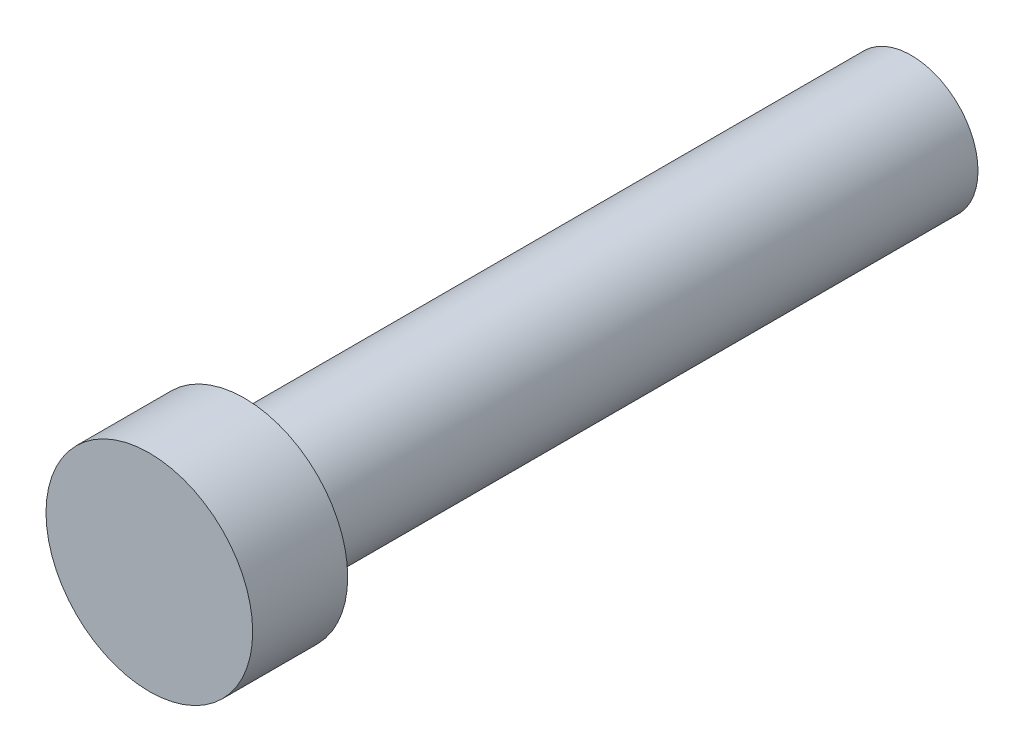
ISO-10303-21;
HEADER;
FILE_DESCRIPTION(('STEP AP214'),'2;1');
FILE_NAME('part.step','',(''),(''),'','','');
FILE_SCHEMA(('AUTOMOTIVE_DESIGN { 1 0 10303 214 1 1 1 1 }'));
ENDSEC;
DATA;
#1=APPLICATION_CONTEXT('core data for automotive mechanical design processes');
#2=APPLICATION_PROTOCOL_DEFINITION('international standard','automotive_design',2000,#1);
#3=PRODUCT_CONTEXT('',#1,'mechanical');
#4=PRODUCT('Part','Part','',(#3));
#5=PRODUCT_RELATED_PRODUCT_CATEGORY('part','',(#4));
#6=PRODUCT_DEFINITION_FORMATION('','',#4);
#7=PRODUCT_DEFINITION_CONTEXT('part definition',#1,'design');
#8=PRODUCT_DEFINITION('design','',#6,#7);
#9=PRODUCT_DEFINITION_SHAPE('','',#8);
#10=(LENGTH_UNIT() NAMED_UNIT(*) SI_UNIT(.MILLI.,.METRE.));
#11=(NAMED_UNIT(*) PLANE_ANGLE_UNIT() SI_UNIT($,.RADIAN.));
#12=(NAMED_UNIT(*) SI_UNIT($,.STERADIAN.) SOLID_ANGLE_UNIT());
#13=UNCERTAINTY_MEASURE_WITH_UNIT(LENGTH_MEASURE(1.E-05),#10,'distance_accuracy_value','');
#14=(GEOMETRIC_REPRESENTATION_CONTEXT(3) GLOBAL_UNCERTAINTY_ASSIGNED_CONTEXT((#13)) GLOBAL_UNIT_ASSIGNED_CONTEXT((#10,
#11,#12)) REPRESENTATION_CONTEXT('',''));
#15=CARTESIAN_POINT('',(0.,0.,0.));
#16=DIRECTION('',(0.,0.,1.));
#17=DIRECTION('',(1.,0.,0.));
#18=AXIS2_PLACEMENT_3D('',#15,#16,#17);
#19=CARTESIAN_POINT('',(0.,0.,40.));
#20=DIRECTION('',(0.,0.,-1.));
#21=DIRECTION('',(-1.,0.,0.));
#22=AXIS2_PLACEMENT_3D('',#19,#20,#21);
#23=CYLINDRICAL_SURFACE('',#22,4.);
#24=CARTESIAN_POINT('',(0.,0.,40.));
#25=DIRECTION('',(0.,0.,1.));
#26=DIRECTION('',(1.,0.,0.));
#27=AXIS2_PLACEMENT_3D('',#24,#25,#26);
#28=CIRCLE('',#27,4.);
#29=CARTESIAN_POINT('',(4.,0.,40.));
#30=VERTEX_POINT('',#29);
#31=EDGE_CURVE('E10',#30,#30,#28,.T.);
#32=ORIENTED_EDGE('',*,*,#31,.F.);
#33=EDGE_LOOP('',(#32));
#34=FACE_BOUND('',#33,.T.);
#35=CARTESIAN_POINT('',(0.,0.,0.));
#36=DIRECTION('',(0.,0.,1.));
#37=DIRECTION('',(1.,0.,0.));
#38=AXIS2_PLACEMENT_3D('',#35,#36,#37);
#39=CIRCLE('',#38,4.);
#40=CARTESIAN_POINT('',(4.,0.,0.));
#41=VERTEX_POINT('',#40);
#42=EDGE_CURVE('E37',#41,#41,#39,.T.);
#43=ORIENTED_EDGE('',*,*,#42,.T.);
#44=EDGE_LOOP('',(#43));
#45=FACE_BOUND('',#44,.T.);
#46=ADVANCED_FACE('F34',(#34,#45),#23,.T.);
#47=CARTESIAN_POINT('',(0.,0.,0.));
#48=DIRECTION('',(0.,0.,1.));
#49=DIRECTION('',(1.,0.,0.));
#50=AXIS2_PLACEMENT_3D('',#47,#48,#49);
#51=PLANE('',#50);
#52=ORIENTED_EDGE('',*,*,#42,.F.);
#53=EDGE_LOOP('',(#52));
#54=FACE_BOUND('',#53,.T.);
#55=ADVANCED_FACE('F57',(#54),#51,.F.);
#56=CARTESIAN_POINT('',(0.,0.,45.7));
#57=DIRECTION('',(0.,0.,-1.));
#58=DIRECTION('',(-1.,0.,0.));
#59=AXIS2_PLACEMENT_3D('',#56,#57,#58);
#60=CYLINDRICAL_SURFACE('',#59,6.1976);
#61=CARTESIAN_POINT('',(0.,0.,45.7));
#62=DIRECTION('',(0.,0.,1.));
#63=DIRECTION('',(1.,0.,0.));
#64=AXIS2_PLACEMENT_3D('',#61,#62,#63);
#65=CIRCLE('',#64,6.1976);
#66=CARTESIAN_POINT('',(6.1976,0.,45.7));
#67=VERTEX_POINT('',#66);
#68=EDGE_CURVE('E44',#67,#67,#65,.T.);
#69=ORIENTED_EDGE('',*,*,#68,.F.);
#70=EDGE_LOOP('',(#69));
#71=FACE_BOUND('',#70,.T.);
#72=CARTESIAN_POINT('',(0.,0.,40.));
#73=DIRECTION('',(0.,0.,1.));
#74=DIRECTION('',(1.,0.,0.));
#75=AXIS2_PLACEMENT_3D('',#72,#73,#74);
#76=CIRCLE('',#75,6.1976);
#77=CARTESIAN_POINT('',(6.1976,0.,40.));
#78=VERTEX_POINT('',#77);
#79=EDGE_CURVE('E46',#78,#78,#76,.T.);
#80=ORIENTED_EDGE('',*,*,#79,.T.);
#81=EDGE_LOOP('',(#80));
#82=FACE_BOUND('',#81,.T.);
#83=ADVANCED_FACE('F54',(#71,#82),#60,.T.);
#84=CARTESIAN_POINT('',(0.,0.,45.7));
#85=DIRECTION('',(0.,0.,1.));
#86=DIRECTION('',(1.,0.,0.));
#87=AXIS2_PLACEMENT_3D('',#84,#85,#86);
#88=PLANE('',#87);
#89=ORIENTED_EDGE('',*,*,#68,.T.);
#90=EDGE_LOOP('',(#89));
#91=FACE_BOUND('',#90,.T.);
#92=ADVANCED_FACE('F52',(#91),#88,.T.);
#93=CARTESIAN_POINT('',(0.,0.,40.));
#94=DIRECTION('',(0.,0.,1.));
#95=DIRECTION('',(1.,0.,0.));
#96=AXIS2_PLACEMENT_3D('',#93,#94,#95);
#97=PLANE('',#96);
#98=ORIENTED_EDGE('',*,*,#31,.T.);
#99=EDGE_LOOP('',(#98));
#100=FACE_BOUND('',#99,.T.);
#101=ORIENTED_EDGE('',*,*,#79,.F.);
#102=EDGE_LOOP('',(#101));
#103=FACE_BOUND('',#102,.T.);
#104=ADVANCED_FACE('F61',(#100,#103),#97,.F.);
#105=CLOSED_SHELL('',(#46,#55,#83,#92,#104));
#106=MANIFOLD_SOLID_BREP('B2',#105);
#107=ADVANCED_BREP_SHAPE_REPRESENTATION('',(#18,#106),#14);
#108=SHAPE_DEFINITION_REPRESENTATION(#9,#107);
ENDSEC;
END-ISO-10303-21;
